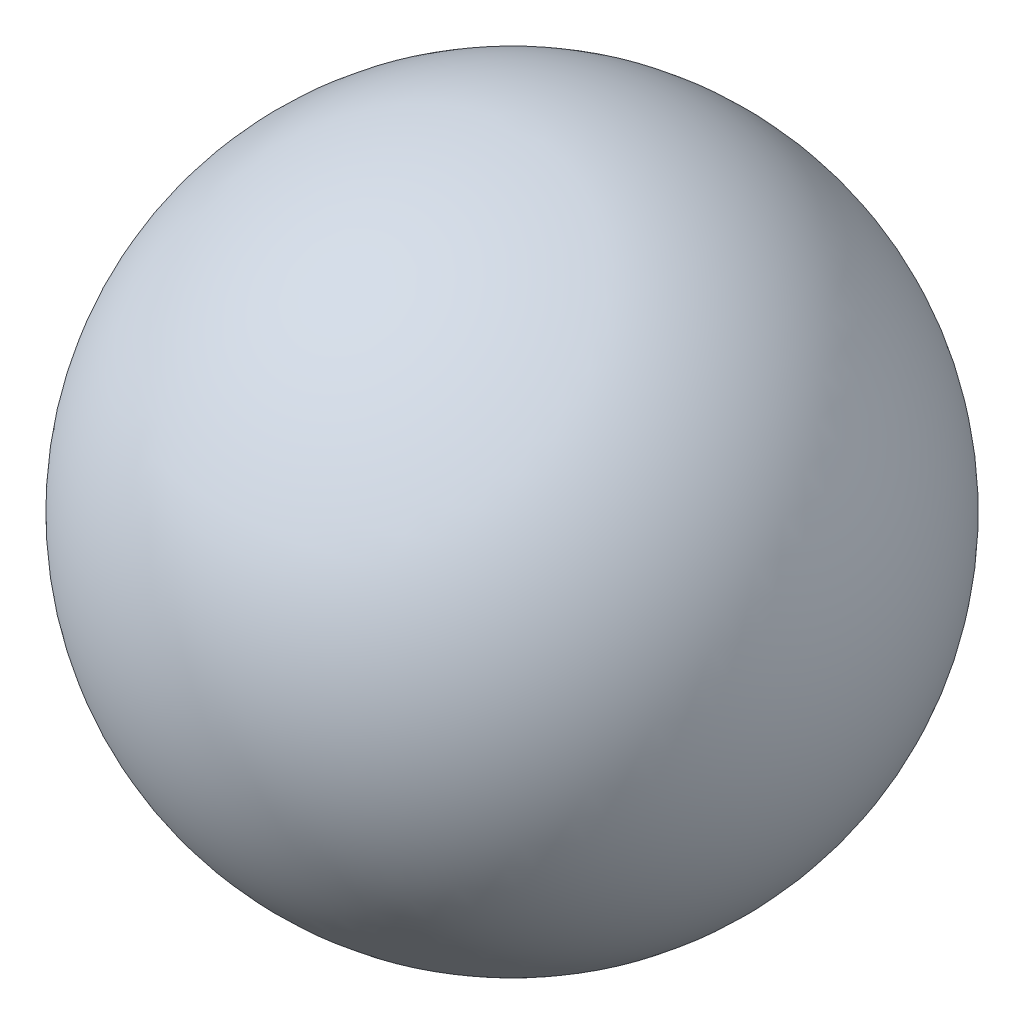
ISO-10303-21;
HEADER;
FILE_DESCRIPTION(('STEP AP214'),'2;1');
FILE_NAME('part.step','',(''),(''),'','','');
FILE_SCHEMA(('AUTOMOTIVE_DESIGN { 1 0 10303 214 1 1 1 1 }'));
ENDSEC;
DATA;
#1=APPLICATION_CONTEXT('core data for automotive mechanical design processes');
#2=APPLICATION_PROTOCOL_DEFINITION('international standard','automotive_design',2000,#1);
#3=PRODUCT_CONTEXT('',#1,'mechanical');
#4=PRODUCT('Part','Part','',(#3));
#5=PRODUCT_RELATED_PRODUCT_CATEGORY('part','',(#4));
#6=PRODUCT_DEFINITION_FORMATION('','',#4);
#7=PRODUCT_DEFINITION_CONTEXT('part definition',#1,'design');
#8=PRODUCT_DEFINITION('design','',#6,#7);
#9=PRODUCT_DEFINITION_SHAPE('','',#8);
#10=(LENGTH_UNIT() NAMED_UNIT(*) SI_UNIT(.MILLI.,.METRE.));
#11=(NAMED_UNIT(*) PLANE_ANGLE_UNIT() SI_UNIT($,.RADIAN.));
#12=(NAMED_UNIT(*) SI_UNIT($,.STERADIAN.) SOLID_ANGLE_UNIT());
#13=UNCERTAINTY_MEASURE_WITH_UNIT(LENGTH_MEASURE(1.E-05),#10,'distance_accuracy_value','');
#14=(GEOMETRIC_REPRESENTATION_CONTEXT(3) GLOBAL_UNCERTAINTY_ASSIGNED_CONTEXT((#13)) GLOBAL_UNIT_ASSIGNED_CONTEXT((#10,
#11,#12)) REPRESENTATION_CONTEXT('',''));
#15=CARTESIAN_POINT('',(0.,0.,0.));
#16=DIRECTION('',(0.,0.,1.));
#17=DIRECTION('',(1.,0.,0.));
#18=AXIS2_PLACEMENT_3D('',#15,#16,#17);
#19=CARTESIAN_POINT('',(0.,-5.76197721591686,0.));
#20=DIRECTION('',(0.,1.,0.));
#21=DIRECTION('',(1.,0.,0.));
#22=AXIS2_PLACEMENT_3D('',#19,#20,#21);
#23=SPHERICAL_SURFACE('',#22,3.5);
#24=CARTESIAN_POINT('',(0.,-2.26197721591686,0.));
#25=VERTEX_POINT('',#24);
#26=VERTEX_LOOP('',#25);
#27=FACE_BOUND('',#26,.T.);
#28=ADVANCED_FACE('F33',(#27),#23,.T.);
#29=CLOSED_SHELL('',(#28));
#30=MANIFOLD_SOLID_BREP('B2',#29);
#31=ADVANCED_BREP_SHAPE_REPRESENTATION('',(#18,#30),#14);
#32=SHAPE_DEFINITION_REPRESENTATION(#9,#31);
ENDSEC;
END-ISO-10303-21;
